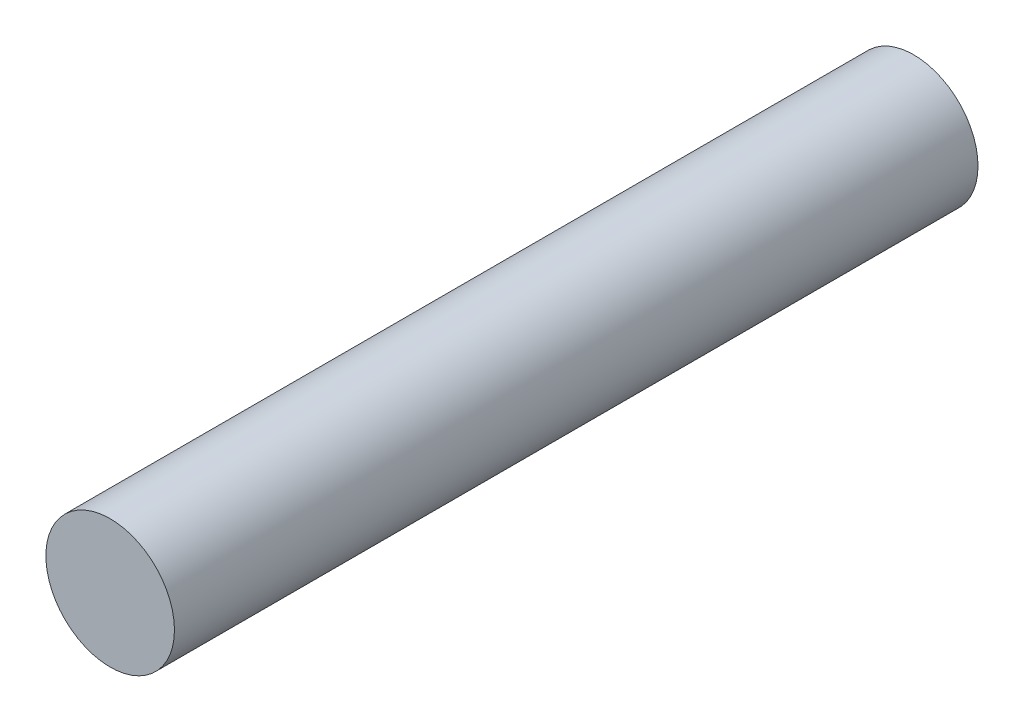
ISO-10303-21;
HEADER;
FILE_DESCRIPTION(('STEP AP214'),'2;1');
FILE_NAME('part.step','',(''),(''),'','','');
FILE_SCHEMA(('AUTOMOTIVE_DESIGN { 1 0 10303 214 1 1 1 1 }'));
ENDSEC;
DATA;
#1=APPLICATION_CONTEXT('core data for automotive mechanical design processes');
#2=APPLICATION_PROTOCOL_DEFINITION('international standard','automotive_design',2000,#1);
#3=PRODUCT_CONTEXT('',#1,'mechanical');
#4=PRODUCT('Part','Part','',(#3));
#5=PRODUCT_RELATED_PRODUCT_CATEGORY('part','',(#4));
#6=PRODUCT_DEFINITION_FORMATION('','',#4);
#7=PRODUCT_DEFINITION_CONTEXT('part definition',#1,'design');
#8=PRODUCT_DEFINITION('design','',#6,#7);
#9=PRODUCT_DEFINITION_SHAPE('','',#8);
#10=(LENGTH_UNIT() NAMED_UNIT(*) SI_UNIT(.MILLI.,.METRE.));
#11=(NAMED_UNIT(*) PLANE_ANGLE_UNIT() SI_UNIT($,.RADIAN.));
#12=(NAMED_UNIT(*) SI_UNIT($,.STERADIAN.) SOLID_ANGLE_UNIT());
#13=UNCERTAINTY_MEASURE_WITH_UNIT(LENGTH_MEASURE(1.E-05),#10,'distance_accuracy_value','');
#14=(GEOMETRIC_REPRESENTATION_CONTEXT(3) GLOBAL_UNCERTAINTY_ASSIGNED_CONTEXT((#13)) GLOBAL_UNIT_ASSIGNED_CONTEXT((#10,
#11,#12)) REPRESENTATION_CONTEXT('',''));
#15=CARTESIAN_POINT('',(0.,0.,0.));
#16=DIRECTION('',(0.,0.,1.));
#17=DIRECTION('',(1.,0.,0.));
#18=AXIS2_PLACEMENT_3D('',#15,#16,#17);
#19=CARTESIAN_POINT('',(0.,0.,6.35));
#20=DIRECTION('',(0.,0.,-1.));
#21=DIRECTION('',(-1.,0.,0.));
#22=AXIS2_PLACEMENT_3D('',#19,#20,#21);
#23=CYLINDRICAL_SURFACE('',#22,1.016);
#24=CARTESIAN_POINT('',(0.,0.,6.35));
#25=DIRECTION('',(0.,0.,1.));
#26=DIRECTION('',(1.,0.,0.));
#27=AXIS2_PLACEMENT_3D('',#24,#25,#26);
#28=CIRCLE('',#27,1.016);
#29=CARTESIAN_POINT('',(1.016,0.,6.35));
#30=VERTEX_POINT('',#29);
#31=EDGE_CURVE('E10',#30,#30,#28,.T.);
#32=ORIENTED_EDGE('',*,*,#31,.F.);
#33=EDGE_LOOP('',(#32));
#34=FACE_BOUND('',#33,.T.);
#35=CARTESIAN_POINT('',(0.,0.,-6.35));
#36=DIRECTION('',(0.,0.,1.));
#37=DIRECTION('',(1.,0.,0.));
#38=AXIS2_PLACEMENT_3D('',#35,#36,#37);
#39=CIRCLE('',#38,1.016);
#40=CARTESIAN_POINT('',(1.016,0.,-6.35));
#41=VERTEX_POINT('',#40);
#42=EDGE_CURVE('E39',#41,#41,#39,.T.);
#43=ORIENTED_EDGE('',*,*,#42,.T.);
#44=EDGE_LOOP('',(#43));
#45=FACE_BOUND('',#44,.T.);
#46=ADVANCED_FACE('F36',(#34,#45),#23,.T.);
#47=CARTESIAN_POINT('',(0.,0.,6.35));
#48=DIRECTION('',(0.,0.,1.));
#49=DIRECTION('',(1.,0.,0.));
#50=AXIS2_PLACEMENT_3D('',#47,#48,#49);
#51=PLANE('',#50);
#52=ORIENTED_EDGE('',*,*,#31,.T.);
#53=EDGE_LOOP('',(#52));
#54=FACE_BOUND('',#53,.T.);
#55=ADVANCED_FACE('F55',(#54),#51,.T.);
#56=CARTESIAN_POINT('',(0.,0.,-6.35));
#57=DIRECTION('',(0.,0.,1.));
#58=DIRECTION('',(1.,0.,0.));
#59=AXIS2_PLACEMENT_3D('',#56,#57,#58);
#60=PLANE('',#59);
#61=ORIENTED_EDGE('',*,*,#42,.F.);
#62=EDGE_LOOP('',(#61));
#63=FACE_BOUND('',#62,.T.);
#64=ADVANCED_FACE('F53',(#63),#60,.F.);
#65=CLOSED_SHELL('',(#46,#55,#64));
#66=MANIFOLD_SOLID_BREP('B2',#65);
#67=ADVANCED_BREP_SHAPE_REPRESENTATION('',(#18,#66),#14);
#68=SHAPE_DEFINITION_REPRESENTATION(#9,#67);
ENDSEC;
END-ISO-10303-21;
